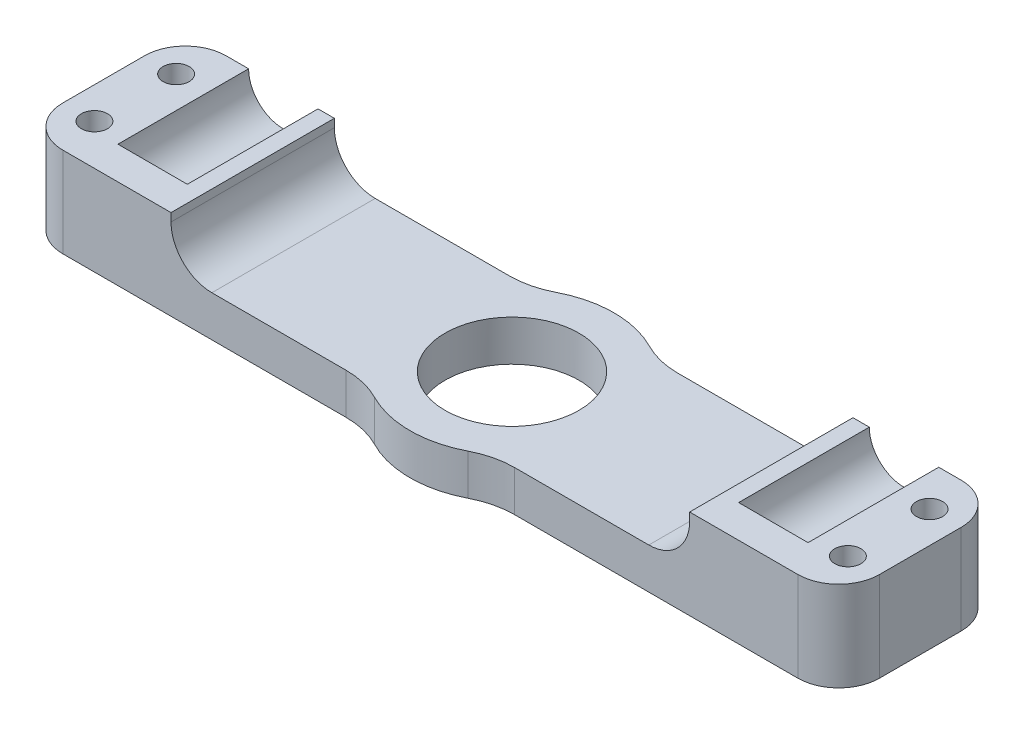
ISO-10303-21;
HEADER;
FILE_DESCRIPTION(('STEP AP214'),'2;1');
FILE_NAME('part.step','',(''),(''),'','','');
FILE_SCHEMA(('AUTOMOTIVE_DESIGN { 1 0 10303 214 1 1 1 1 }'));
ENDSEC;
DATA;
#1=APPLICATION_CONTEXT('core data for automotive mechanical design processes');
#2=APPLICATION_PROTOCOL_DEFINITION('international standard','automotive_design',2000,#1);
#3=PRODUCT_CONTEXT('',#1,'mechanical');
#4=PRODUCT('Part','Part','',(#3));
#5=PRODUCT_RELATED_PRODUCT_CATEGORY('part','',(#4));
#6=PRODUCT_DEFINITION_FORMATION('','',#4);
#7=PRODUCT_DEFINITION_CONTEXT('part definition',#1,'design');
#8=PRODUCT_DEFINITION('design','',#6,#7);
#9=PRODUCT_DEFINITION_SHAPE('','',#8);
#10=(LENGTH_UNIT() NAMED_UNIT(*) SI_UNIT(.MILLI.,.METRE.));
#11=(NAMED_UNIT(*) PLANE_ANGLE_UNIT() SI_UNIT($,.RADIAN.));
#12=(NAMED_UNIT(*) SI_UNIT($,.STERADIAN.) SOLID_ANGLE_UNIT());
#13=UNCERTAINTY_MEASURE_WITH_UNIT(LENGTH_MEASURE(1.E-05),#10,'distance_accuracy_value','');
#14=(GEOMETRIC_REPRESENTATION_CONTEXT(3) GLOBAL_UNCERTAINTY_ASSIGNED_CONTEXT((#13)) GLOBAL_UNIT_ASSIGNED_CONTEXT((#10,
#11,#12)) REPRESENTATION_CONTEXT('',''));
#15=CARTESIAN_POINT('',(0.,0.,0.));
#16=DIRECTION('',(0.,0.,1.));
#17=DIRECTION('',(1.,0.,0.));
#18=AXIS2_PLACEMENT_3D('',#15,#16,#17);
#19=CARTESIAN_POINT('',(-38.,11.,-10.));
#20=DIRECTION('',(0.,0.,1.));
#21=DIRECTION('',(1.,0.,0.));
#22=AXIS2_PLACEMENT_3D('',#19,#20,#21);
#23=CYLINDRICAL_SURFACE('',#22,4.25000000000001);
#24=CARTESIAN_POINT('',(-38.,11.,6.));
#25=DIRECTION('',(0.,0.,1.));
#26=DIRECTION('',(1.,0.,0.));
#27=AXIS2_PLACEMENT_3D('',#24,#25,#26);
#28=CIRCLE('',#27,4.25);
#29=CARTESIAN_POINT('',(-42.25,11.,6.));
#30=VERTEX_POINT('',#29);
#31=CARTESIAN_POINT('',(-33.75,11.,6.));
#32=VERTEX_POINT('',#31);
#33=EDGE_CURVE('E54',#30,#32,#28,.T.);
#34=ORIENTED_EDGE('',*,*,#33,.T.);
#35=DIRECTION('',(0.,0.,1.));
#36=VECTOR('',#35,1.);
#37=CARTESIAN_POINT('',(-33.75,11.,-10.));
#38=LINE('',#37,#36);
#39=CARTESIAN_POINT('',(-33.75,11.,-10.));
#40=VERTEX_POINT('',#39);
#41=EDGE_CURVE('E309',#32,#40,#38,.F.);
#42=ORIENTED_EDGE('',*,*,#41,.T.);
#43=CARTESIAN_POINT('',(-38.,11.,-10.));
#44=DIRECTION('',(0.,0.,1.));
#45=DIRECTION('',(1.,0.,0.));
#46=AXIS2_PLACEMENT_3D('',#43,#44,#45);
#47=CIRCLE('',#46,4.25000000000001);
#48=CARTESIAN_POINT('',(-42.25,11.,-10.));
#49=VERTEX_POINT('',#48);
#50=EDGE_CURVE('E328',#49,#40,#47,.T.);
#51=ORIENTED_EDGE('',*,*,#50,.F.);
#52=DIRECTION('',(0.,0.,1.));
#53=VECTOR('',#52,1.);
#54=CARTESIAN_POINT('',(-42.25,11.,-10.));
#55=LINE('',#54,#53);
#56=EDGE_CURVE('E59',#49,#30,#55,.T.);
#57=ORIENTED_EDGE('',*,*,#56,.T.);
#58=EDGE_LOOP('',(#34,#42,#51,#57));
#59=FACE_BOUND('',#58,.T.);
#60=ADVANCED_FACE('F39',(#59),#23,.F.);
#61=CARTESIAN_POINT('',(38.,11.,-10.));
#62=DIRECTION('',(0.,0.,1.));
#63=DIRECTION('',(1.,0.,0.));
#64=AXIS2_PLACEMENT_3D('',#61,#62,#63);
#65=CYLINDRICAL_SURFACE('',#64,4.25000000000001);
#66=CARTESIAN_POINT('',(38.,11.,6.));
#67=DIRECTION('',(0.,0.,1.));
#68=DIRECTION('',(1.,0.,0.));
#69=AXIS2_PLACEMENT_3D('',#66,#67,#68);
#70=CIRCLE('',#69,4.25);
#71=CARTESIAN_POINT('',(33.75,11.,6.));
#72=VERTEX_POINT('',#71);
#73=CARTESIAN_POINT('',(42.25,11.,6.));
#74=VERTEX_POINT('',#73);
#75=EDGE_CURVE('E224',#72,#74,#70,.T.);
#76=ORIENTED_EDGE('',*,*,#75,.T.);
#77=DIRECTION('',(0.,0.,1.));
#78=VECTOR('',#77,1.);
#79=CARTESIAN_POINT('',(42.25,11.,-10.));
#80=LINE('',#79,#78);
#81=CARTESIAN_POINT('',(42.25,11.,-10.));
#82=VERTEX_POINT('',#81);
#83=EDGE_CURVE('E210',#74,#82,#80,.F.);
#84=ORIENTED_EDGE('',*,*,#83,.T.);
#85=CARTESIAN_POINT('',(38.,11.,-10.));
#86=DIRECTION('',(0.,0.,1.));
#87=DIRECTION('',(-1.,0.,0.));
#88=AXIS2_PLACEMENT_3D('',#85,#86,#87);
#89=CIRCLE('',#88,4.25000000000001);
#90=CARTESIAN_POINT('',(33.75,11.,-10.));
#91=VERTEX_POINT('',#90);
#92=EDGE_CURVE('E332',#91,#82,#89,.T.);
#93=ORIENTED_EDGE('',*,*,#92,.F.);
#94=DIRECTION('',(0.,0.,1.));
#95=VECTOR('',#94,1.);
#96=CARTESIAN_POINT('',(33.75,11.,-10.));
#97=LINE('',#96,#95);
#98=EDGE_CURVE('E226',#91,#72,#97,.T.);
#99=ORIENTED_EDGE('',*,*,#98,.T.);
#100=EDGE_LOOP('',(#76,#84,#93,#99));
#101=FACE_BOUND('',#100,.T.);
#102=ADVANCED_FACE('F225',(#101),#65,.F.);
#103=CARTESIAN_POINT('',(-44.,22.,-10.));
#104=DIRECTION('',(0.,0.,1.));
#105=DIRECTION('',(1.,0.,0.));
#106=AXIS2_PLACEMENT_3D('',#103,#104,#105);
#107=PLANE('',#106);
#108=DIRECTION('',(1.,0.,0.));
#109=VECTOR('',#108,1.);
#110=CARTESIAN_POINT('',(-44.,11.,-10.));
#111=LINE('',#110,#109);
#112=CARTESIAN_POINT('',(45.,11.,-10.));
#113=VERTEX_POINT('',#112);
#114=EDGE_CURVE('E217',#82,#113,#111,.T.);
#115=ORIENTED_EDGE('',*,*,#114,.T.);
#116=DIRECTION('',(0.,1.,0.));
#117=VECTOR('',#116,1.);
#118=CARTESIAN_POINT('',(45.,0.,-10.));
#119=LINE('',#118,#117);
#120=CARTESIAN_POINT('',(45.,0.,-10.));
#121=VERTEX_POINT('',#120);
#122=EDGE_CURVE('E11',#113,#121,#119,.F.);
#123=ORIENTED_EDGE('',*,*,#122,.T.);
#124=DIRECTION('',(-1.,0.,0.));
#125=VECTOR('',#124,1.);
#126=CARTESIAN_POINT('',(-44.,0.,-10.));
#127=LINE('',#126,#125);
#128=CARTESIAN_POINT('',(10.3077640640441,0.,-10.));
#129=VERTEX_POINT('',#128);
#130=EDGE_CURVE('E334',#121,#129,#127,.T.);
#131=ORIENTED_EDGE('',*,*,#130,.T.);
#132=DIRECTION('',(0.,1.,0.));
#133=VECTOR('',#132,1.);
#134=CARTESIAN_POINT('',(10.3077640640441,22.,-10.));
#135=LINE('',#134,#133);
#136=CARTESIAN_POINT('',(10.3077640640441,5.,-10.));
#137=VERTEX_POINT('',#136);
#138=EDGE_CURVE('E349',#129,#137,#135,.T.);
#139=ORIENTED_EDGE('',*,*,#138,.T.);
#140=DIRECTION('',(1.,0.,0.));
#141=VECTOR('',#140,1.);
#142=CARTESIAN_POINT('',(-44.,4.99999999999999,-10.));
#143=LINE('',#142,#141);
#144=CARTESIAN_POINT('',(26.75,5.,-10.));
#145=VERTEX_POINT('',#144);
#146=EDGE_CURVE('E287',#137,#145,#143,.T.);
#147=ORIENTED_EDGE('',*,*,#146,.T.);
#148=CARTESIAN_POINT('',(26.75,10.,-10.));
#149=DIRECTION('',(0.,0.,1.));
#150=DIRECTION('',(1.,0.,0.));
#151=AXIS2_PLACEMENT_3D('',#148,#149,#150);
#152=CIRCLE('',#151,5.);
#153=CARTESIAN_POINT('',(31.75,10.,-10.));
#154=VERTEX_POINT('',#153);
#155=EDGE_CURVE('E394',#145,#154,#152,.T.);
#156=ORIENTED_EDGE('',*,*,#155,.T.);
#157=DIRECTION('',(0.,1.,0.));
#158=VECTOR('',#157,1.);
#159=CARTESIAN_POINT('',(31.75,22.,-10.));
#160=LINE('',#159,#158);
#161=CARTESIAN_POINT('',(31.75,11.,-10.));
#162=VERTEX_POINT('',#161);
#163=EDGE_CURVE('E278',#154,#162,#160,.T.);
#164=ORIENTED_EDGE('',*,*,#163,.T.);
#165=EDGE_CURVE('E312',#162,#91,#111,.T.);
#166=ORIENTED_EDGE('',*,*,#165,.T.);
#167=ORIENTED_EDGE('',*,*,#92,.T.);
#168=EDGE_LOOP('',(#115,#123,#131,#139,#147,#156,#164,#166,#167));
#169=FACE_BOUND('',#168,.T.);
#170=ADVANCED_FACE('F510',(#169),#107,.F.);
#171=CARTESIAN_POINT('',(-44.,22.,10.));
#172=DIRECTION('',(0.,0.,-1.));
#173=DIRECTION('',(-1.,0.,0.));
#174=AXIS2_PLACEMENT_3D('',#171,#172,#173);
#175=PLANE('',#174);
#176=DIRECTION('',(-1.,0.,0.));
#177=VECTOR('',#176,1.);
#178=CARTESIAN_POINT('',(-44.,11.,10.));
#179=LINE('',#178,#177);
#180=CARTESIAN_POINT('',(-31.75,11.,10.));
#181=VERTEX_POINT('',#180);
#182=CARTESIAN_POINT('',(-45.,11.,10.));
#183=VERTEX_POINT('',#182);
#184=EDGE_CURVE('E221',#181,#183,#179,.T.);
#185=ORIENTED_EDGE('',*,*,#184,.T.);
#186=DIRECTION('',(0.,-1.,0.));
#187=VECTOR('',#186,1.);
#188=CARTESIAN_POINT('',(-45.,0.,10.));
#189=LINE('',#188,#187);
#190=CARTESIAN_POINT('',(-45.,0.,10.));
#191=VERTEX_POINT('',#190);
#192=EDGE_CURVE('E396',#183,#191,#189,.T.);
#193=ORIENTED_EDGE('',*,*,#192,.T.);
#194=DIRECTION('',(1.,0.,0.));
#195=VECTOR('',#194,1.);
#196=CARTESIAN_POINT('',(-44.,0.,10.));
#197=LINE('',#196,#195);
#198=CARTESIAN_POINT('',(-10.3077640640441,0.,10.));
#199=VERTEX_POINT('',#198);
#200=EDGE_CURVE('E337',#191,#199,#197,.T.);
#201=ORIENTED_EDGE('',*,*,#200,.T.);
#202=DIRECTION('',(0.,1.,0.));
#203=VECTOR('',#202,1.);
#204=CARTESIAN_POINT('',(-10.3077640640441,22.,10.));
#205=LINE('',#204,#203);
#206=CARTESIAN_POINT('',(-10.3077640640441,4.99999999999999,10.));
#207=VERTEX_POINT('',#206);
#208=EDGE_CURVE('E346',#199,#207,#205,.T.);
#209=ORIENTED_EDGE('',*,*,#208,.T.);
#210=DIRECTION('',(-1.,0.,0.));
#211=VECTOR('',#210,1.);
#212=CARTESIAN_POINT('',(-44.,4.99999999999999,10.));
#213=LINE('',#212,#211);
#214=CARTESIAN_POINT('',(-26.75,5.,10.));
#215=VERTEX_POINT('',#214);
#216=EDGE_CURVE('E293',#207,#215,#213,.T.);
#217=ORIENTED_EDGE('',*,*,#216,.T.);
#218=CARTESIAN_POINT('',(-26.75,9.99999999999999,10.));
#219=DIRECTION('',(0.,0.,-1.));
#220=DIRECTION('',(-1.,0.,0.));
#221=AXIS2_PLACEMENT_3D('',#218,#219,#220);
#222=CIRCLE('',#221,5.);
#223=CARTESIAN_POINT('',(-31.75,10.,10.));
#224=VERTEX_POINT('',#223);
#225=EDGE_CURVE('E388',#215,#224,#222,.T.);
#226=ORIENTED_EDGE('',*,*,#225,.T.);
#227=DIRECTION('',(0.,1.,0.));
#228=VECTOR('',#227,1.);
#229=CARTESIAN_POINT('',(-31.75,22.,10.));
#230=LINE('',#229,#228);
#231=EDGE_CURVE('E272',#224,#181,#230,.T.);
#232=ORIENTED_EDGE('',*,*,#231,.T.);
#233=EDGE_LOOP('',(#185,#193,#201,#209,#217,#226,#232));
#234=FACE_BOUND('',#233,.T.);
#235=ADVANCED_FACE('F464',(#234),#175,.F.);
#236=CARTESIAN_POINT('',(-10.3077640640441,0.,-10.));
#237=VERTEX_POINT('',#236);
#238=CARTESIAN_POINT('',(-45.,0.,-10.));
#239=VERTEX_POINT('',#238);
#240=EDGE_CURVE('E331',#237,#239,#127,.T.);
#241=ORIENTED_EDGE('',*,*,#240,.T.);
#242=DIRECTION('',(0.,1.,0.));
#243=VECTOR('',#242,1.);
#244=CARTESIAN_POINT('',(-45.,11.,-10.));
#245=LINE('',#244,#243);
#246=CARTESIAN_POINT('',(-45.,11.,-10.));
#247=VERTEX_POINT('',#246);
#248=EDGE_CURVE('E415',#239,#247,#245,.T.);
#249=ORIENTED_EDGE('',*,*,#248,.T.);
#250=DIRECTION('',(1.,0.,0.));
#251=VECTOR('',#250,1.);
#252=CARTESIAN_POINT('',(-44.,11.,-10.));
#253=LINE('',#252,#251);
#254=EDGE_CURVE('E310',#247,#49,#253,.T.);
#255=ORIENTED_EDGE('',*,*,#254,.T.);
#256=ORIENTED_EDGE('',*,*,#50,.T.);
#257=CARTESIAN_POINT('',(-31.75,11.,-10.));
#258=VERTEX_POINT('',#257);
#259=EDGE_CURVE('E306',#40,#258,#253,.T.);
#260=ORIENTED_EDGE('',*,*,#259,.T.);
#261=DIRECTION('',(0.,-1.,0.));
#262=VECTOR('',#261,1.);
#263=CARTESIAN_POINT('',(-31.75,22.,-10.));
#264=LINE('',#263,#262);
#265=CARTESIAN_POINT('',(-31.75,10.,-10.));
#266=VERTEX_POINT('',#265);
#267=EDGE_CURVE('E269',#258,#266,#264,.T.);
#268=ORIENTED_EDGE('',*,*,#267,.T.);
#269=CARTESIAN_POINT('',(-26.75,9.99999999999999,-10.));
#270=DIRECTION('',(0.,0.,1.));
#271=DIRECTION('',(1.,0.,0.));
#272=AXIS2_PLACEMENT_3D('',#269,#270,#271);
#273=CIRCLE('',#272,5.);
#274=CARTESIAN_POINT('',(-26.75,5.,-10.));
#275=VERTEX_POINT('',#274);
#276=EDGE_CURVE('E390',#266,#275,#273,.T.);
#277=ORIENTED_EDGE('',*,*,#276,.T.);
#278=DIRECTION('',(1.,0.,0.));
#279=VECTOR('',#278,1.);
#280=CARTESIAN_POINT('',(-44.,4.99999999999999,-10.));
#281=LINE('',#280,#279);
#282=CARTESIAN_POINT('',(-10.3077640640441,4.99999999999999,-10.));
#283=VERTEX_POINT('',#282);
#284=EDGE_CURVE('E280',#275,#283,#281,.T.);
#285=ORIENTED_EDGE('',*,*,#284,.T.);
#286=DIRECTION('',(0.,1.,0.));
#287=VECTOR('',#286,1.);
#288=CARTESIAN_POINT('',(-10.3077640640441,22.,-10.));
#289=LINE('',#288,#287);
#290=EDGE_CURVE('E357',#283,#237,#289,.F.);
#291=ORIENTED_EDGE('',*,*,#290,.T.);
#292=EDGE_LOOP('',(#241,#249,#255,#256,#260,#268,#277,#285,#291));
#293=FACE_BOUND('',#292,.T.);
#294=ADVANCED_FACE('F483',(#293),#107,.F.);
#295=CARTESIAN_POINT('',(10.3077640640441,0.,10.));
#296=VERTEX_POINT('',#295);
#297=CARTESIAN_POINT('',(45.,0.,10.));
#298=VERTEX_POINT('',#297);
#299=EDGE_CURVE('E336',#296,#298,#197,.T.);
#300=ORIENTED_EDGE('',*,*,#299,.T.);
#301=DIRECTION('',(0.,-1.,0.));
#302=VECTOR('',#301,1.);
#303=CARTESIAN_POINT('',(45.,11.,10.));
#304=LINE('',#303,#302);
#305=CARTESIAN_POINT('',(45.,11.,10.));
#306=VERTEX_POINT('',#305);
#307=EDGE_CURVE('E424',#298,#306,#304,.F.);
#308=ORIENTED_EDGE('',*,*,#307,.T.);
#309=DIRECTION('',(-1.,0.,0.));
#310=VECTOR('',#309,1.);
#311=CARTESIAN_POINT('',(-44.,11.,10.));
#312=LINE('',#311,#310);
#313=CARTESIAN_POINT('',(31.75,11.,10.));
#314=VERTEX_POINT('',#313);
#315=EDGE_CURVE('E317',#306,#314,#312,.T.);
#316=ORIENTED_EDGE('',*,*,#315,.T.);
#317=DIRECTION('',(0.,-1.,0.));
#318=VECTOR('',#317,1.);
#319=CARTESIAN_POINT('',(31.75,22.,10.));
#320=LINE('',#319,#318);
#321=CARTESIAN_POINT('',(31.75,10.,10.));
#322=VERTEX_POINT('',#321);
#323=EDGE_CURVE('E275',#314,#322,#320,.T.);
#324=ORIENTED_EDGE('',*,*,#323,.T.);
#325=CARTESIAN_POINT('',(26.75,10.,10.));
#326=DIRECTION('',(0.,0.,-1.));
#327=DIRECTION('',(-1.,0.,0.));
#328=AXIS2_PLACEMENT_3D('',#325,#326,#327);
#329=CIRCLE('',#328,5.);
#330=CARTESIAN_POINT('',(26.75,5.,10.));
#331=VERTEX_POINT('',#330);
#332=EDGE_CURVE('E392',#322,#331,#329,.T.);
#333=ORIENTED_EDGE('',*,*,#332,.T.);
#334=DIRECTION('',(-1.,0.,0.));
#335=VECTOR('',#334,1.);
#336=CARTESIAN_POINT('',(-44.,4.99999999999999,10.));
#337=LINE('',#336,#335);
#338=CARTESIAN_POINT('',(10.3077640640441,5.,10.));
#339=VERTEX_POINT('',#338);
#340=EDGE_CURVE('E301',#331,#339,#337,.T.);
#341=ORIENTED_EDGE('',*,*,#340,.T.);
#342=DIRECTION('',(0.,1.,0.));
#343=VECTOR('',#342,1.);
#344=CARTESIAN_POINT('',(10.3077640640441,22.,10.));
#345=LINE('',#344,#343);
#346=EDGE_CURVE('E339',#339,#296,#345,.F.);
#347=ORIENTED_EDGE('',*,*,#346,.T.);
#348=EDGE_LOOP('',(#300,#308,#316,#324,#333,#341,#347));
#349=FACE_BOUND('',#348,.T.);
#350=ADVANCED_FACE('F444',(#349),#175,.F.);
#351=CARTESIAN_POINT('',(0.,0.,0.));
#352=DIRECTION('',(0.,-1.,0.));
#353=DIRECTION('',(0.,0.,-1.));
#354=AXIS2_PLACEMENT_3D('',#351,#352,#353);
#355=PLANE('',#354);
#356=CARTESIAN_POINT('',(-46.125,0.,5.));
#357=DIRECTION('',(0.,-1.,0.));
#358=DIRECTION('',(0.,0.,1.));
#359=AXIS2_PLACEMENT_3D('',#356,#357,#358);
#360=CIRCLE('',#359,1.6);
#361=CARTESIAN_POINT('',(-46.125,0.,6.6));
#362=VERTEX_POINT('',#361);
#363=EDGE_CURVE('E237',#362,#362,#360,.T.);
#364=ORIENTED_EDGE('',*,*,#363,.F.);
#365=EDGE_LOOP('',(#364));
#366=FACE_BOUND('',#365,.T.);
#367=CARTESIAN_POINT('',(-46.125,0.,-5.));
#368=DIRECTION('',(0.,-1.,0.));
#369=DIRECTION('',(0.,0.,1.));
#370=AXIS2_PLACEMENT_3D('',#367,#368,#369);
#371=CIRCLE('',#370,1.6);
#372=CARTESIAN_POINT('',(-46.125,0.,-3.4));
#373=VERTEX_POINT('',#372);
#374=EDGE_CURVE('E233',#373,#373,#371,.T.);
#375=ORIENTED_EDGE('',*,*,#374,.F.);
#376=EDGE_LOOP('',(#375));
#377=FACE_BOUND('',#376,.T.);
#378=CARTESIAN_POINT('',(46.125,0.,5.));
#379=DIRECTION('',(0.,1.,0.));
#380=DIRECTION('',(0.,0.,1.));
#381=AXIS2_PLACEMENT_3D('',#378,#379,#380);
#382=CIRCLE('',#381,1.6);
#383=CARTESIAN_POINT('',(46.125,0.,6.6));
#384=VERTEX_POINT('',#383);
#385=EDGE_CURVE('E252',#384,#384,#382,.T.);
#386=ORIENTED_EDGE('',*,*,#385,.T.);
#387=EDGE_LOOP('',(#386));
#388=FACE_BOUND('',#387,.T.);
#389=CARTESIAN_POINT('',(46.125,0.,-5.));
#390=DIRECTION('',(0.,1.,0.));
#391=DIRECTION('',(0.,0.,1.));
#392=AXIS2_PLACEMENT_3D('',#389,#390,#391);
#393=CIRCLE('',#392,1.6);
#394=CARTESIAN_POINT('',(46.125,0.,-3.4));
#395=VERTEX_POINT('',#394);
#396=EDGE_CURVE('E251',#395,#395,#393,.T.);
#397=ORIENTED_EDGE('',*,*,#396,.T.);
#398=EDGE_LOOP('',(#397));
#399=FACE_BOUND('',#398,.T.);
#400=CARTESIAN_POINT('',(0.,0.,0.));
#401=DIRECTION('',(0.,1.,0.));
#402=DIRECTION('',(0.,0.,1.));
#403=AXIS2_PLACEMENT_3D('',#400,#401,#402);
#404=CIRCLE('',#403,8.2);
#405=CARTESIAN_POINT('',(0.,0.,8.2));
#406=VERTEX_POINT('',#405);
#407=EDGE_CURVE('E321',#406,#406,#404,.T.);
#408=ORIENTED_EDGE('',*,*,#407,.T.);
#409=EDGE_LOOP('',(#408));
#410=FACE_BOUND('',#409,.T.);
#411=ORIENTED_EDGE('',*,*,#200,.F.);
#412=CARTESIAN_POINT('',(-45.,0.,5.));
#413=DIRECTION('',(0.,-1.,0.));
#414=DIRECTION('',(0.,0.,-1.));
#415=AXIS2_PLACEMENT_3D('',#412,#413,#414);
#416=CIRCLE('',#415,5.);
#417=CARTESIAN_POINT('',(-50.,0.,5.));
#418=VERTEX_POINT('',#417);
#419=EDGE_CURVE('E405',#191,#418,#416,.T.);
#420=ORIENTED_EDGE('',*,*,#419,.T.);
#421=DIRECTION('',(0.,0.,-1.));
#422=VECTOR('',#421,1.);
#423=CARTESIAN_POINT('',(-50.,0.,10.));
#424=LINE('',#423,#422);
#425=CARTESIAN_POINT('',(-50.,0.,-5.));
#426=VERTEX_POINT('',#425);
#427=EDGE_CURVE('E240',#418,#426,#424,.T.);
#428=ORIENTED_EDGE('',*,*,#427,.T.);
#429=CARTESIAN_POINT('',(-45.,0.,-5.));
#430=DIRECTION('',(0.,-1.,0.));
#431=DIRECTION('',(0.,0.,-1.));
#432=AXIS2_PLACEMENT_3D('',#429,#430,#431);
#433=CIRCLE('',#432,5.);
#434=EDGE_CURVE('E403',#426,#239,#433,.T.);
#435=ORIENTED_EDGE('',*,*,#434,.T.);
#436=ORIENTED_EDGE('',*,*,#240,.F.);
#437=CARTESIAN_POINT('',(-10.3077640640441,0.,-20.));
#438=DIRECTION('',(0.,-1.,0.));
#439=DIRECTION('',(0.,0.,-1.));
#440=AXIS2_PLACEMENT_3D('',#437,#438,#439);
#441=CIRCLE('',#440,10.);
#442=CARTESIAN_POINT('',(-5.72653559113563,0.,-11.1111111111111));
#443=VERTEX_POINT('',#442);
#444=EDGE_CURVE('E367',#237,#443,#441,.F.);
#445=ORIENTED_EDGE('',*,*,#444,.T.);
#446=CARTESIAN_POINT('',(0.,0.,0.));
#447=DIRECTION('',(0.,-1.,0.));
#448=DIRECTION('',(0.,0.,-1.));
#449=AXIS2_PLACEMENT_3D('',#446,#447,#448);
#450=CIRCLE('',#449,12.5);
#451=CARTESIAN_POINT('',(5.72653559113563,0.,-11.1111111111111));
#452=VERTEX_POINT('',#451);
#453=EDGE_CURVE('E324',#452,#443,#450,.F.);
#454=ORIENTED_EDGE('',*,*,#453,.F.);
#455=CARTESIAN_POINT('',(10.3077640640441,0.,-20.));
#456=DIRECTION('',(0.,-1.,0.));
#457=DIRECTION('',(0.,0.,-1.));
#458=AXIS2_PLACEMENT_3D('',#455,#456,#457);
#459=CIRCLE('',#458,10.);
#460=EDGE_CURVE('E364',#452,#129,#459,.F.);
#461=ORIENTED_EDGE('',*,*,#460,.T.);
#462=ORIENTED_EDGE('',*,*,#130,.F.);
#463=CARTESIAN_POINT('',(45.,0.,-5.));
#464=DIRECTION('',(0.,-1.,0.));
#465=DIRECTION('',(0.,0.,-1.));
#466=AXIS2_PLACEMENT_3D('',#463,#464,#465);
#467=CIRCLE('',#466,5.);
#468=CARTESIAN_POINT('',(50.,0.,-5.));
#469=VERTEX_POINT('',#468);
#470=EDGE_CURVE('E399',#121,#469,#467,.T.);
#471=ORIENTED_EDGE('',*,*,#470,.T.);
#472=DIRECTION('',(0.,0.,-1.));
#473=VECTOR('',#472,1.);
#474=CARTESIAN_POINT('',(50.,0.,10.));
#475=LINE('',#474,#473);
#476=CARTESIAN_POINT('',(50.,0.,5.));
#477=VERTEX_POINT('',#476);
#478=EDGE_CURVE('E255',#477,#469,#475,.T.);
#479=ORIENTED_EDGE('',*,*,#478,.F.);
#480=CARTESIAN_POINT('',(45.,0.,5.));
#481=DIRECTION('',(0.,-1.,0.));
#482=DIRECTION('',(0.,0.,-1.));
#483=AXIS2_PLACEMENT_3D('',#480,#481,#482);
#484=CIRCLE('',#483,5.);
#485=EDGE_CURVE('E401',#477,#298,#484,.T.);
#486=ORIENTED_EDGE('',*,*,#485,.T.);
#487=ORIENTED_EDGE('',*,*,#299,.F.);
#488=CARTESIAN_POINT('',(10.3077640640441,0.,20.));
#489=DIRECTION('',(0.,-1.,0.));
#490=DIRECTION('',(0.,0.,-1.));
#491=AXIS2_PLACEMENT_3D('',#488,#489,#490);
#492=CIRCLE('',#491,10.);
#493=CARTESIAN_POINT('',(5.72653559113563,0.,11.1111111111111));
#494=VERTEX_POINT('',#493);
#495=EDGE_CURVE('E359',#296,#494,#492,.F.);
#496=ORIENTED_EDGE('',*,*,#495,.T.);
#497=CARTESIAN_POINT('',(-5.72653559113563,0.,11.1111111111111));
#498=VERTEX_POINT('',#497);
#499=EDGE_CURVE('E327',#498,#494,#450,.F.);
#500=ORIENTED_EDGE('',*,*,#499,.F.);
#501=CARTESIAN_POINT('',(-10.3077640640441,0.,20.));
#502=DIRECTION('',(0.,-1.,0.));
#503=DIRECTION('',(0.,0.,-1.));
#504=AXIS2_PLACEMENT_3D('',#501,#502,#503);
#505=CIRCLE('',#504,10.);
#506=EDGE_CURVE('E361',#498,#199,#505,.F.);
#507=ORIENTED_EDGE('',*,*,#506,.T.);
#508=EDGE_LOOP('',(#411,#420,#428,#435,#436,#445,#454,#461,#462,#471,#479,#486,#487,#496,#500,#507));
#509=FACE_BOUND('',#508,.T.);
#510=ADVANCED_FACE('F442',(#366,#377,#388,#399,#410,#509),#355,.T.);
#511=CARTESIAN_POINT('',(0.,-35.3553390593274,0.));
#512=DIRECTION('',(0.,1.,0.));
#513=DIRECTION('',(0.,0.,1.));
#514=AXIS2_PLACEMENT_3D('',#511,#512,#513);
#515=CYLINDRICAL_SURFACE('',#514,12.5);
#516=CARTESIAN_POINT('',(0.,4.99999999999999,0.));
#517=DIRECTION('',(0.,-1.,0.));
#518=DIRECTION('',(1.,0.,0.));
#519=AXIS2_PLACEMENT_3D('',#516,#517,#518);
#520=CIRCLE('',#519,12.5);
#521=CARTESIAN_POINT('',(-5.72653559113563,4.99999999999999,11.1111111111111));
#522=VERTEX_POINT('',#521);
#523=CARTESIAN_POINT('',(5.72653559113563,4.99999999999999,11.1111111111111));
#524=VERTEX_POINT('',#523);
#525=EDGE_CURVE('E294',#522,#524,#520,.F.);
#526=ORIENTED_EDGE('',*,*,#525,.F.);
#527=DIRECTION('',(0.,1.,0.));
#528=VECTOR('',#527,1.);
#529=CARTESIAN_POINT('',(-5.72653559113563,-35.3553390593274,11.1111111111111));
#530=LINE('',#529,#528);
#531=EDGE_CURVE('E341',#522,#498,#530,.F.);
#532=ORIENTED_EDGE('',*,*,#531,.T.);
#533=ORIENTED_EDGE('',*,*,#499,.T.);
#534=DIRECTION('',(0.,1.,0.));
#535=VECTOR('',#534,1.);
#536=CARTESIAN_POINT('',(5.72653559113563,-35.3553390593274,11.1111111111111));
#537=LINE('',#536,#535);
#538=EDGE_CURVE('E343',#494,#524,#537,.T.);
#539=ORIENTED_EDGE('',*,*,#538,.T.);
#540=EDGE_LOOP('',(#526,#532,#533,#539));
#541=FACE_BOUND('',#540,.T.);
#542=ADVANCED_FACE('F456',(#541),#515,.T.);
#543=DIRECTION('',(0.,1.,0.));
#544=VECTOR('',#543,1.);
#545=CARTESIAN_POINT('',(-5.72653559113563,-35.3553390593274,-11.1111111111111));
#546=LINE('',#545,#544);
#547=CARTESIAN_POINT('',(-5.72653559113563,4.99999999999999,-11.1111111111111));
#548=VERTEX_POINT('',#547);
#549=EDGE_CURVE('E352',#443,#548,#546,.T.);
#550=ORIENTED_EDGE('',*,*,#549,.T.);
#551=CARTESIAN_POINT('',(0.,4.99999999999999,0.));
#552=DIRECTION('',(0.,-1.,0.));
#553=DIRECTION('',(1.,0.,0.));
#554=AXIS2_PLACEMENT_3D('',#551,#552,#553);
#555=CIRCLE('',#554,12.5);
#556=CARTESIAN_POINT('',(5.72653559113563,4.99999999999999,-11.1111111111111));
#557=VERTEX_POINT('',#556);
#558=EDGE_CURVE('E281',#557,#548,#555,.F.);
#559=ORIENTED_EDGE('',*,*,#558,.F.);
#560=DIRECTION('',(0.,1.,0.));
#561=VECTOR('',#560,1.);
#562=CARTESIAN_POINT('',(5.72653559113563,-35.3553390593274,-11.1111111111111));
#563=LINE('',#562,#561);
#564=EDGE_CURVE('E355',#557,#452,#563,.F.);
#565=ORIENTED_EDGE('',*,*,#564,.T.);
#566=ORIENTED_EDGE('',*,*,#453,.T.);
#567=EDGE_LOOP('',(#550,#559,#565,#566));
#568=FACE_BOUND('',#567,.T.);
#569=ADVANCED_FACE('F492',(#568),#515,.T.);
#570=CARTESIAN_POINT('',(0.,0.,0.));
#571=DIRECTION('',(0.,1.,0.));
#572=DIRECTION('',(0.,0.,1.));
#573=AXIS2_PLACEMENT_3D('',#570,#571,#572);
#574=CYLINDRICAL_SURFACE('',#573,8.2);
#575=CARTESIAN_POINT('',(0.,5.,0.));
#576=DIRECTION('',(0.,-1.,0.));
#577=DIRECTION('',(1.,0.,0.));
#578=AXIS2_PLACEMENT_3D('',#575,#576,#577);
#579=CIRCLE('',#578,8.2);
#580=CARTESIAN_POINT('',(8.2,5.,0.));
#581=VERTEX_POINT('',#580);
#582=EDGE_CURVE('E303',#581,#581,#579,.F.);
#583=ORIENTED_EDGE('',*,*,#582,.T.);
#584=EDGE_LOOP('',(#583));
#585=FACE_BOUND('',#584,.T.);
#586=ORIENTED_EDGE('',*,*,#407,.F.);
#587=EDGE_LOOP('',(#586));
#588=FACE_BOUND('',#587,.T.);
#589=ADVANCED_FACE('F550',(#585,#588),#574,.F.);
#590=CARTESIAN_POINT('',(10.3077640640441,-35.3553390593274,20.));
#591=DIRECTION('',(0.,1.,0.));
#592=DIRECTION('',(0.,0.,1.));
#593=AXIS2_PLACEMENT_3D('',#590,#591,#592);
#594=CYLINDRICAL_SURFACE('',#593,10.);
#595=ORIENTED_EDGE('',*,*,#346,.F.);
#596=CARTESIAN_POINT('',(10.3077640640441,5.,20.));
#597=DIRECTION('',(0.,-1.,0.));
#598=DIRECTION('',(1.,0.,0.));
#599=AXIS2_PLACEMENT_3D('',#596,#597,#598);
#600=CIRCLE('',#599,10.);
#601=EDGE_CURVE('E296',#339,#524,#600,.F.);
#602=ORIENTED_EDGE('',*,*,#601,.T.);
#603=ORIENTED_EDGE('',*,*,#538,.F.);
#604=ORIENTED_EDGE('',*,*,#495,.F.);
#605=EDGE_LOOP('',(#595,#602,#603,#604));
#606=FACE_BOUND('',#605,.T.);
#607=ADVANCED_FACE('F451',(#606),#594,.F.);
#608=CARTESIAN_POINT('',(-10.3077640640441,-35.3553390593274,20.));
#609=DIRECTION('',(0.,1.,0.));
#610=DIRECTION('',(0.,0.,1.));
#611=AXIS2_PLACEMENT_3D('',#608,#609,#610);
#612=CYLINDRICAL_SURFACE('',#611,10.);
#613=ORIENTED_EDGE('',*,*,#531,.F.);
#614=CARTESIAN_POINT('',(-10.3077640640441,4.99999999999999,20.));
#615=DIRECTION('',(0.,-1.,0.));
#616=DIRECTION('',(1.,0.,0.));
#617=AXIS2_PLACEMENT_3D('',#614,#615,#616);
#618=CIRCLE('',#617,10.);
#619=EDGE_CURVE('E290',#522,#207,#618,.F.);
#620=ORIENTED_EDGE('',*,*,#619,.T.);
#621=ORIENTED_EDGE('',*,*,#208,.F.);
#622=ORIENTED_EDGE('',*,*,#506,.F.);
#623=EDGE_LOOP('',(#613,#620,#621,#622));
#624=FACE_BOUND('',#623,.T.);
#625=ADVANCED_FACE('F460',(#624),#612,.F.);
#626=CARTESIAN_POINT('',(10.3077640640441,-35.3553390593274,-20.));
#627=DIRECTION('',(0.,1.,0.));
#628=DIRECTION('',(0.,0.,1.));
#629=AXIS2_PLACEMENT_3D('',#626,#627,#628);
#630=CYLINDRICAL_SURFACE('',#629,10.);
#631=ORIENTED_EDGE('',*,*,#564,.F.);
#632=CARTESIAN_POINT('',(10.3077640640441,5.,-20.));
#633=DIRECTION('',(0.,-1.,0.));
#634=DIRECTION('',(1.,0.,0.));
#635=AXIS2_PLACEMENT_3D('',#632,#633,#634);
#636=CIRCLE('',#635,10.);
#637=EDGE_CURVE('E283',#557,#137,#636,.F.);
#638=ORIENTED_EDGE('',*,*,#637,.T.);
#639=ORIENTED_EDGE('',*,*,#138,.F.);
#640=ORIENTED_EDGE('',*,*,#460,.F.);
#641=EDGE_LOOP('',(#631,#638,#639,#640));
#642=FACE_BOUND('',#641,.T.);
#643=ADVANCED_FACE('F503',(#642),#630,.F.);
#644=CARTESIAN_POINT('',(-10.3077640640441,-35.3553390593274,-20.));
#645=DIRECTION('',(0.,1.,0.));
#646=DIRECTION('',(0.,0.,1.));
#647=AXIS2_PLACEMENT_3D('',#644,#645,#646);
#648=CYLINDRICAL_SURFACE('',#647,10.);
#649=ORIENTED_EDGE('',*,*,#290,.F.);
#650=CARTESIAN_POINT('',(-10.3077640640441,4.99999999999999,-20.));
#651=DIRECTION('',(0.,-1.,0.));
#652=DIRECTION('',(1.,0.,0.));
#653=AXIS2_PLACEMENT_3D('',#650,#651,#652);
#654=CIRCLE('',#653,10.);
#655=EDGE_CURVE('E375',#283,#548,#654,.F.);
#656=ORIENTED_EDGE('',*,*,#655,.T.);
#657=ORIENTED_EDGE('',*,*,#549,.F.);
#658=ORIENTED_EDGE('',*,*,#444,.F.);
#659=EDGE_LOOP('',(#649,#656,#657,#658));
#660=FACE_BOUND('',#659,.T.);
#661=ADVANCED_FACE('F495',(#660),#648,.F.);
#662=CARTESIAN_POINT('',(44.,11.,-13.5));
#663=DIRECTION('',(0.,-1.,0.));
#664=DIRECTION('',(0.,0.,-1.));
#665=AXIS2_PLACEMENT_3D('',#662,#663,#664);
#666=PLANE('',#665);
#667=CARTESIAN_POINT('',(-46.125,11.,5.));
#668=DIRECTION('',(0.,-1.,0.));
#669=DIRECTION('',(0.,0.,1.));
#670=AXIS2_PLACEMENT_3D('',#667,#668,#669);
#671=CIRCLE('',#670,1.6);
#672=CARTESIAN_POINT('',(-46.125,11.,6.6));
#673=VERTEX_POINT('',#672);
#674=EDGE_CURVE('E241',#673,#673,#671,.T.);
#675=ORIENTED_EDGE('',*,*,#674,.T.);
#676=EDGE_LOOP('',(#675));
#677=FACE_BOUND('',#676,.T.);
#678=CARTESIAN_POINT('',(-46.125,11.,-5.));
#679=DIRECTION('',(0.,-1.,0.));
#680=DIRECTION('',(0.,0.,1.));
#681=AXIS2_PLACEMENT_3D('',#678,#679,#680);
#682=CIRCLE('',#681,1.6);
#683=CARTESIAN_POINT('',(-46.125,11.,-3.4));
#684=VERTEX_POINT('',#683);
#685=EDGE_CURVE('E230',#684,#684,#682,.T.);
#686=ORIENTED_EDGE('',*,*,#685,.T.);
#687=EDGE_LOOP('',(#686));
#688=FACE_BOUND('',#687,.T.);
#689=DIRECTION('',(0.,0.,1.));
#690=VECTOR('',#689,1.);
#691=CARTESIAN_POINT('',(-50.,11.,-10.));
#692=LINE('',#691,#690);
#693=CARTESIAN_POINT('',(-50.,11.,-5.));
#694=VERTEX_POINT('',#693);
#695=CARTESIAN_POINT('',(-50.,11.,5.));
#696=VERTEX_POINT('',#695);
#697=EDGE_CURVE('E248',#694,#696,#692,.T.);
#698=ORIENTED_EDGE('',*,*,#697,.T.);
#699=CARTESIAN_POINT('',(-45.,11.,5.));
#700=DIRECTION('',(0.,-1.,0.));
#701=DIRECTION('',(0.,0.,-1.));
#702=AXIS2_PLACEMENT_3D('',#699,#700,#701);
#703=CIRCLE('',#702,5.);
#704=EDGE_CURVE('E413',#696,#183,#703,.F.);
#705=ORIENTED_EDGE('',*,*,#704,.T.);
#706=ORIENTED_EDGE('',*,*,#184,.F.);
#707=DIRECTION('',(0.,0.,-1.));
#708=VECTOR('',#707,1.);
#709=CARTESIAN_POINT('',(-31.75,11.,-13.5));
#710=LINE('',#709,#708);
#711=EDGE_CURVE('E369',#181,#258,#710,.T.);
#712=ORIENTED_EDGE('',*,*,#711,.T.);
#713=ORIENTED_EDGE('',*,*,#259,.F.);
#714=ORIENTED_EDGE('',*,*,#41,.F.);
#715=DIRECTION('',(-1.,0.,0.));
#716=VECTOR('',#715,1.);
#717=CARTESIAN_POINT('',(-42.25,11.,6.));
#718=LINE('',#717,#716);
#719=EDGE_CURVE('E937',#32,#30,#718,.T.);
#720=ORIENTED_EDGE('',*,*,#719,.T.);
#721=ORIENTED_EDGE('',*,*,#56,.F.);
#722=ORIENTED_EDGE('',*,*,#254,.F.);
#723=CARTESIAN_POINT('',(-45.,11.,-5.));
#724=DIRECTION('',(0.,-1.,0.));
#725=DIRECTION('',(0.,0.,-1.));
#726=AXIS2_PLACEMENT_3D('',#723,#724,#725);
#727=CIRCLE('',#726,5.);
#728=EDGE_CURVE('E411',#247,#694,#727,.F.);
#729=ORIENTED_EDGE('',*,*,#728,.T.);
#730=EDGE_LOOP('',(#698,#705,#706,#712,#713,#714,#720,#721,#722,#729));
#731=FACE_BOUND('',#730,.T.);
#732=ADVANCED_FACE('F475',(#677,#688,#731),#666,.F.);
#733=CARTESIAN_POINT('',(46.125,11.,5.));
#734=DIRECTION('',(0.,1.,0.));
#735=DIRECTION('',(0.,0.,1.));
#736=AXIS2_PLACEMENT_3D('',#733,#734,#735);
#737=CIRCLE('',#736,1.6);
#738=CARTESIAN_POINT('',(46.125,11.,6.6));
#739=VERTEX_POINT('',#738);
#740=EDGE_CURVE('E256',#739,#739,#737,.T.);
#741=ORIENTED_EDGE('',*,*,#740,.F.);
#742=EDGE_LOOP('',(#741));
#743=FACE_BOUND('',#742,.T.);
#744=CARTESIAN_POINT('',(46.125,11.,-5.));
#745=DIRECTION('',(0.,1.,0.));
#746=DIRECTION('',(0.,0.,1.));
#747=AXIS2_PLACEMENT_3D('',#744,#745,#746);
#748=CIRCLE('',#747,1.6);
#749=CARTESIAN_POINT('',(46.125,11.,-3.4));
#750=VERTEX_POINT('',#749);
#751=EDGE_CURVE('E259',#750,#750,#748,.T.);
#752=ORIENTED_EDGE('',*,*,#751,.F.);
#753=EDGE_LOOP('',(#752));
#754=FACE_BOUND('',#753,.T.);
#755=ORIENTED_EDGE('',*,*,#315,.F.);
#756=CARTESIAN_POINT('',(45.,11.,5.));
#757=DIRECTION('',(0.,-1.,0.));
#758=DIRECTION('',(0.,0.,-1.));
#759=AXIS2_PLACEMENT_3D('',#756,#757,#758);
#760=CIRCLE('',#759,5.);
#761=CARTESIAN_POINT('',(50.,11.,5.));
#762=VERTEX_POINT('',#761);
#763=EDGE_CURVE('E47',#306,#762,#760,.F.);
#764=ORIENTED_EDGE('',*,*,#763,.T.);
#765=DIRECTION('',(0.,0.,1.));
#766=VECTOR('',#765,1.);
#767=CARTESIAN_POINT('',(50.,11.,-10.));
#768=LINE('',#767,#766);
#769=CARTESIAN_POINT('',(50.,11.,-5.));
#770=VERTEX_POINT('',#769);
#771=EDGE_CURVE('E266',#770,#762,#768,.T.);
#772=ORIENTED_EDGE('',*,*,#771,.F.);
#773=CARTESIAN_POINT('',(45.,11.,-5.));
#774=DIRECTION('',(0.,-1.,0.));
#775=DIRECTION('',(0.,0.,-1.));
#776=AXIS2_PLACEMENT_3D('',#773,#774,#775);
#777=CIRCLE('',#776,5.);
#778=EDGE_CURVE('E427',#770,#113,#777,.F.);
#779=ORIENTED_EDGE('',*,*,#778,.T.);
#780=ORIENTED_EDGE('',*,*,#114,.F.);
#781=ORIENTED_EDGE('',*,*,#83,.F.);
#782=DIRECTION('',(-1.,0.,0.));
#783=VECTOR('',#782,1.);
#784=CARTESIAN_POINT('',(33.75,11.,6.));
#785=LINE('',#784,#783);
#786=EDGE_CURVE('E215',#74,#72,#785,.T.);
#787=ORIENTED_EDGE('',*,*,#786,.T.);
#788=ORIENTED_EDGE('',*,*,#98,.F.);
#789=ORIENTED_EDGE('',*,*,#165,.F.);
#790=DIRECTION('',(0.,0.,1.));
#791=VECTOR('',#790,1.);
#792=CARTESIAN_POINT('',(31.75,11.,-13.5));
#793=LINE('',#792,#791);
#794=EDGE_CURVE('E372',#162,#314,#793,.T.);
#795=ORIENTED_EDGE('',*,*,#794,.T.);
#796=EDGE_LOOP('',(#755,#764,#772,#779,#780,#781,#787,#788,#789,#795));
#797=FACE_BOUND('',#796,.T.);
#798=ADVANCED_FACE('F212',(#743,#754,#797),#666,.F.);
#799=CARTESIAN_POINT('',(31.75,5.,-12.5));
#800=DIRECTION('',(0.,-1.,0.));
#801=DIRECTION('',(1.,0.,0.));
#802=AXIS2_PLACEMENT_3D('',#799,#800,#801);
#803=PLANE('',#802);
#804=ORIENTED_EDGE('',*,*,#284,.F.);
#805=DIRECTION('',(0.,0.,1.));
#806=VECTOR('',#805,1.);
#807=CARTESIAN_POINT('',(-26.75,4.99999999999999,10.));
#808=LINE('',#807,#806);
#809=EDGE_CURVE('E380',#275,#215,#808,.T.);
#810=ORIENTED_EDGE('',*,*,#809,.T.);
#811=ORIENTED_EDGE('',*,*,#216,.F.);
#812=ORIENTED_EDGE('',*,*,#619,.F.);
#813=ORIENTED_EDGE('',*,*,#525,.T.);
#814=ORIENTED_EDGE('',*,*,#601,.F.);
#815=ORIENTED_EDGE('',*,*,#340,.F.);
#816=DIRECTION('',(0.,0.,1.));
#817=VECTOR('',#816,1.);
#818=CARTESIAN_POINT('',(26.75,5.,-10.));
#819=LINE('',#818,#817);
#820=EDGE_CURVE('E378',#331,#145,#819,.F.);
#821=ORIENTED_EDGE('',*,*,#820,.T.);
#822=ORIENTED_EDGE('',*,*,#146,.F.);
#823=ORIENTED_EDGE('',*,*,#637,.F.);
#824=ORIENTED_EDGE('',*,*,#558,.T.);
#825=ORIENTED_EDGE('',*,*,#655,.F.);
#826=EDGE_LOOP('',(#804,#810,#811,#812,#813,#814,#815,#821,#822,#823,#824,#825));
#827=FACE_BOUND('',#826,.T.);
#828=ORIENTED_EDGE('',*,*,#582,.F.);
#829=EDGE_LOOP('',(#828));
#830=FACE_BOUND('',#829,.T.);
#831=ADVANCED_FACE('F499',(#827,#830),#803,.F.);
#832=CARTESIAN_POINT('',(31.75,13.,-12.5));
#833=DIRECTION('',(1.,0.,0.));
#834=DIRECTION('',(0.,0.,-1.));
#835=AXIS2_PLACEMENT_3D('',#832,#833,#834);
#836=PLANE('',#835);
#837=ORIENTED_EDGE('',*,*,#163,.F.);
#838=DIRECTION('',(0.,0.,1.));
#839=VECTOR('',#838,1.);
#840=CARTESIAN_POINT('',(31.75,10.,10.));
#841=LINE('',#840,#839);
#842=EDGE_CURVE('E385',#154,#322,#841,.T.);
#843=ORIENTED_EDGE('',*,*,#842,.T.);
#844=ORIENTED_EDGE('',*,*,#323,.F.);
#845=ORIENTED_EDGE('',*,*,#794,.F.);
#846=EDGE_LOOP('',(#837,#843,#844,#845));
#847=FACE_BOUND('',#846,.T.);
#848=ADVANCED_FACE('F515',(#847),#836,.F.);
#849=CARTESIAN_POINT('',(-31.75,13.,-12.5));
#850=DIRECTION('',(-1.,0.,0.));
#851=DIRECTION('',(0.,-1.,0.));
#852=AXIS2_PLACEMENT_3D('',#849,#850,#851);
#853=PLANE('',#852);
#854=ORIENTED_EDGE('',*,*,#231,.F.);
#855=DIRECTION('',(0.,0.,1.));
#856=VECTOR('',#855,1.);
#857=CARTESIAN_POINT('',(-31.75,10.,-10.));
#858=LINE('',#857,#856);
#859=EDGE_CURVE('E383',#224,#266,#858,.F.);
#860=ORIENTED_EDGE('',*,*,#859,.T.);
#861=ORIENTED_EDGE('',*,*,#267,.F.);
#862=ORIENTED_EDGE('',*,*,#711,.F.);
#863=EDGE_LOOP('',(#854,#860,#861,#862));
#864=FACE_BOUND('',#863,.T.);
#865=ADVANCED_FACE('F526',(#864),#853,.F.);
#866=CARTESIAN_POINT('',(-26.75,9.99999999999999,-12.5));
#867=DIRECTION('',(0.,0.,-1.));
#868=DIRECTION('',(-1.,0.,0.));
#869=AXIS2_PLACEMENT_3D('',#866,#867,#868);
#870=CYLINDRICAL_SURFACE('',#869,5.);
#871=ORIENTED_EDGE('',*,*,#276,.F.);
#872=ORIENTED_EDGE('',*,*,#859,.F.);
#873=ORIENTED_EDGE('',*,*,#225,.F.);
#874=ORIENTED_EDGE('',*,*,#809,.F.);
#875=EDGE_LOOP('',(#871,#872,#873,#874));
#876=FACE_BOUND('',#875,.T.);
#877=ADVANCED_FACE('F528',(#876),#870,.F.);
#878=CARTESIAN_POINT('',(26.75,10.,-12.5));
#879=DIRECTION('',(0.,0.,-1.));
#880=DIRECTION('',(-1.,0.,0.));
#881=AXIS2_PLACEMENT_3D('',#878,#879,#880);
#882=CYLINDRICAL_SURFACE('',#881,5.);
#883=ORIENTED_EDGE('',*,*,#155,.F.);
#884=ORIENTED_EDGE('',*,*,#820,.F.);
#885=ORIENTED_EDGE('',*,*,#332,.F.);
#886=ORIENTED_EDGE('',*,*,#842,.F.);
#887=EDGE_LOOP('',(#883,#884,#885,#886));
#888=FACE_BOUND('',#887,.T.);
#889=ADVANCED_FACE('F519',(#888),#882,.F.);
#890=CARTESIAN_POINT('',(50.,0.,0.));
#891=DIRECTION('',(1.,0.,0.));
#892=DIRECTION('',(0.,0.,-1.));
#893=AXIS2_PLACEMENT_3D('',#890,#891,#892);
#894=PLANE('',#893);
#895=ORIENTED_EDGE('',*,*,#771,.T.);
#896=DIRECTION('',(0.,-1.,0.));
#897=VECTOR('',#896,1.);
#898=CARTESIAN_POINT('',(50.,0.,5.));
#899=LINE('',#898,#897);
#900=EDGE_CURVE('E421',#762,#477,#899,.T.);
#901=ORIENTED_EDGE('',*,*,#900,.T.);
#902=ORIENTED_EDGE('',*,*,#478,.T.);
#903=DIRECTION('',(0.,1.,0.));
#904=VECTOR('',#903,1.);
#905=CARTESIAN_POINT('',(50.,11.,-5.));
#906=LINE('',#905,#904);
#907=EDGE_CURVE('E418',#469,#770,#906,.T.);
#908=ORIENTED_EDGE('',*,*,#907,.T.);
#909=EDGE_LOOP('',(#895,#901,#902,#908));
#910=FACE_BOUND('',#909,.T.);
#911=ADVANCED_FACE('F434',(#910),#894,.T.);
#912=CARTESIAN_POINT('',(46.125,0.,-5.));
#913=DIRECTION('',(0.,1.,0.));
#914=DIRECTION('',(0.,0.,1.));
#915=AXIS2_PLACEMENT_3D('',#912,#913,#914);
#916=CYLINDRICAL_SURFACE('',#915,1.6);
#917=ORIENTED_EDGE('',*,*,#396,.F.);
#918=EDGE_LOOP('',(#917));
#919=FACE_BOUND('',#918,.T.);
#920=ORIENTED_EDGE('',*,*,#751,.T.);
#921=EDGE_LOOP('',(#920));
#922=FACE_BOUND('',#921,.T.);
#923=ADVANCED_FACE('F592',(#919,#922),#916,.F.);
#924=CARTESIAN_POINT('',(46.125,0.,5.));
#925=DIRECTION('',(0.,1.,0.));
#926=DIRECTION('',(0.,0.,1.));
#927=AXIS2_PLACEMENT_3D('',#924,#925,#926);
#928=CYLINDRICAL_SURFACE('',#927,1.6);
#929=ORIENTED_EDGE('',*,*,#385,.F.);
#930=EDGE_LOOP('',(#929));
#931=FACE_BOUND('',#930,.T.);
#932=ORIENTED_EDGE('',*,*,#740,.T.);
#933=EDGE_LOOP('',(#932));
#934=FACE_BOUND('',#933,.T.);
#935=ADVANCED_FACE('F589',(#931,#934),#928,.F.);
#936=CARTESIAN_POINT('',(-50.,0.,0.));
#937=DIRECTION('',(-1.,0.,0.));
#938=DIRECTION('',(0.,0.,-1.));
#939=AXIS2_PLACEMENT_3D('',#936,#937,#938);
#940=PLANE('',#939);
#941=ORIENTED_EDGE('',*,*,#427,.F.);
#942=DIRECTION('',(0.,-1.,0.));
#943=VECTOR('',#942,1.);
#944=CARTESIAN_POINT('',(-50.,11.,5.));
#945=LINE('',#944,#943);
#946=EDGE_CURVE('E409',#418,#696,#945,.F.);
#947=ORIENTED_EDGE('',*,*,#946,.T.);
#948=ORIENTED_EDGE('',*,*,#697,.F.);
#949=DIRECTION('',(0.,1.,0.));
#950=VECTOR('',#949,1.);
#951=CARTESIAN_POINT('',(-50.,0.,-5.));
#952=LINE('',#951,#950);
#953=EDGE_CURVE('E407',#694,#426,#952,.F.);
#954=ORIENTED_EDGE('',*,*,#953,.T.);
#955=EDGE_LOOP('',(#941,#947,#948,#954));
#956=FACE_BOUND('',#955,.T.);
#957=ADVANCED_FACE('F472',(#956),#940,.T.);
#958=CARTESIAN_POINT('',(-46.125,0.,-5.));
#959=DIRECTION('',(0.,1.,0.));
#960=DIRECTION('',(0.,0.,1.));
#961=AXIS2_PLACEMENT_3D('',#958,#959,#960);
#962=CYLINDRICAL_SURFACE('',#961,1.6);
#963=ORIENTED_EDGE('',*,*,#374,.T.);
#964=EDGE_LOOP('',(#963));
#965=FACE_BOUND('',#964,.T.);
#966=ORIENTED_EDGE('',*,*,#685,.F.);
#967=EDGE_LOOP('',(#966));
#968=FACE_BOUND('',#967,.T.);
#969=ADVANCED_FACE('F582',(#965,#968),#962,.F.);
#970=CARTESIAN_POINT('',(-46.125,0.,5.));
#971=DIRECTION('',(0.,1.,0.));
#972=DIRECTION('',(0.,0.,1.));
#973=AXIS2_PLACEMENT_3D('',#970,#971,#972);
#974=CYLINDRICAL_SURFACE('',#973,1.6);
#975=ORIENTED_EDGE('',*,*,#363,.T.);
#976=EDGE_LOOP('',(#975));
#977=FACE_BOUND('',#976,.T.);
#978=ORIENTED_EDGE('',*,*,#674,.F.);
#979=EDGE_LOOP('',(#978));
#980=FACE_BOUND('',#979,.T.);
#981=ADVANCED_FACE('F563',(#977,#980),#974,.F.);
#982=CARTESIAN_POINT('',(-45.,22.,5.));
#983=DIRECTION('',(0.,1.,0.));
#984=DIRECTION('',(0.,0.,1.));
#985=AXIS2_PLACEMENT_3D('',#982,#983,#984);
#986=CYLINDRICAL_SURFACE('',#985,5.);
#987=ORIENTED_EDGE('',*,*,#704,.F.);
#988=ORIENTED_EDGE('',*,*,#946,.F.);
#989=ORIENTED_EDGE('',*,*,#419,.F.);
#990=ORIENTED_EDGE('',*,*,#192,.F.);
#991=EDGE_LOOP('',(#987,#988,#989,#990));
#992=FACE_BOUND('',#991,.T.);
#993=ADVANCED_FACE('F468',(#992),#986,.T.);
#994=CARTESIAN_POINT('',(-45.,22.,-5.));
#995=DIRECTION('',(0.,-1.,0.));
#996=DIRECTION('',(0.,0.,-1.));
#997=AXIS2_PLACEMENT_3D('',#994,#995,#996);
#998=CYLINDRICAL_SURFACE('',#997,5.);
#999=ORIENTED_EDGE('',*,*,#434,.F.);
#1000=ORIENTED_EDGE('',*,*,#953,.F.);
#1001=ORIENTED_EDGE('',*,*,#728,.F.);
#1002=ORIENTED_EDGE('',*,*,#248,.F.);
#1003=EDGE_LOOP('',(#999,#1000,#1001,#1002));
#1004=FACE_BOUND('',#1003,.T.);
#1005=ADVANCED_FACE('F480',(#1004),#998,.T.);
#1006=CARTESIAN_POINT('',(45.,0.,5.));
#1007=DIRECTION('',(0.,1.,0.));
#1008=DIRECTION('',(0.,0.,1.));
#1009=AXIS2_PLACEMENT_3D('',#1006,#1007,#1008);
#1010=CYLINDRICAL_SURFACE('',#1009,5.);
#1011=ORIENTED_EDGE('',*,*,#763,.F.);
#1012=ORIENTED_EDGE('',*,*,#307,.F.);
#1013=ORIENTED_EDGE('',*,*,#485,.F.);
#1014=ORIENTED_EDGE('',*,*,#900,.F.);
#1015=EDGE_LOOP('',(#1011,#1012,#1013,#1014));
#1016=FACE_BOUND('',#1015,.T.);
#1017=ADVANCED_FACE('F437',(#1016),#1010,.T.);
#1018=CARTESIAN_POINT('',(45.,0.,-5.));
#1019=DIRECTION('',(0.,-1.,0.));
#1020=DIRECTION('',(0.,0.,-1.));
#1021=AXIS2_PLACEMENT_3D('',#1018,#1019,#1020);
#1022=CYLINDRICAL_SURFACE('',#1021,5.);
#1023=ORIENTED_EDGE('',*,*,#470,.F.);
#1024=ORIENTED_EDGE('',*,*,#122,.F.);
#1025=ORIENTED_EDGE('',*,*,#778,.F.);
#1026=ORIENTED_EDGE('',*,*,#907,.F.);
#1027=EDGE_LOOP('',(#1023,#1024,#1025,#1026));
#1028=FACE_BOUND('',#1027,.T.);
#1029=ADVANCED_FACE('F41',(#1028),#1022,.T.);
#1030=CARTESIAN_POINT('',(38.,11.,6.));
#1031=DIRECTION('',(0.,0.,1.));
#1032=DIRECTION('',(1.,0.,0.));
#1033=AXIS2_PLACEMENT_3D('',#1030,#1031,#1032);
#1034=PLANE('',#1033);
#1035=ORIENTED_EDGE('',*,*,#75,.F.);
#1036=ORIENTED_EDGE('',*,*,#786,.F.);
#1037=EDGE_LOOP('',(#1035,#1036));
#1038=FACE_BOUND('',#1037,.T.);
#1039=ADVANCED_FACE('F229',(#1038),#1034,.F.);
#1040=CARTESIAN_POINT('',(-38.,11.,6.));
#1041=DIRECTION('',(0.,0.,1.));
#1042=DIRECTION('',(1.,0.,0.));
#1043=AXIS2_PLACEMENT_3D('',#1040,#1041,#1042);
#1044=PLANE('',#1043);
#1045=ORIENTED_EDGE('',*,*,#33,.F.);
#1046=ORIENTED_EDGE('',*,*,#719,.F.);
#1047=EDGE_LOOP('',(#1045,#1046));
#1048=FACE_BOUND('',#1047,.T.);
#1049=ADVANCED_FACE('F572',(#1048),#1044,.F.);
#1050=CLOSED_SHELL('',(#60,#102,#170,#235,#294,#350,#510,#542,#569,#589,#607,#625,#643,#661,
#732,#798,#831,#848,#865,#877,#889,#911,#923,#935,#957,#969,#981,#993,#1005,#1017,#1029,#1039,#1049));
#1051=MANIFOLD_SOLID_BREP('B2',#1050);
#1052=ADVANCED_BREP_SHAPE_REPRESENTATION('',(#18,#1051),#14);
#1053=SHAPE_DEFINITION_REPRESENTATION(#9,#1052);
ENDSEC;
END-ISO-10303-21;
